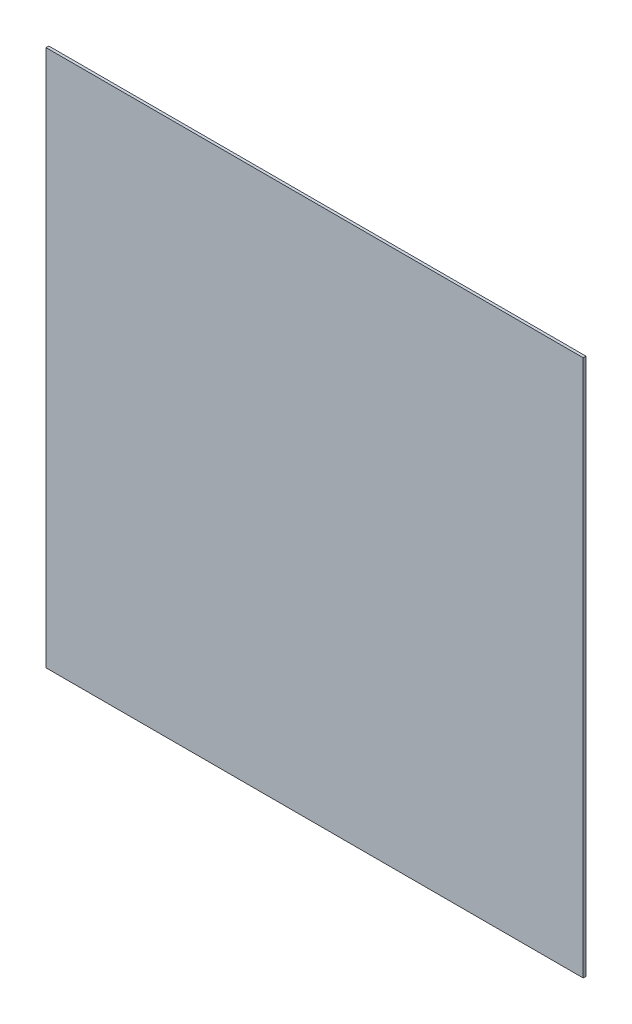
ISO-10303-21;
HEADER;
FILE_DESCRIPTION(('STEP AP214'),'2;1');
FILE_NAME('part.step','',(''),(''),'','','');
FILE_SCHEMA(('AUTOMOTIVE_DESIGN { 1 0 10303 214 1 1 1 1 }'));
ENDSEC;
DATA;
#1=APPLICATION_CONTEXT('core data for automotive mechanical design processes');
#2=APPLICATION_PROTOCOL_DEFINITION('international standard','automotive_design',2000,#1);
#3=PRODUCT_CONTEXT('',#1,'mechanical');
#4=PRODUCT('Part','Part','',(#3));
#5=PRODUCT_RELATED_PRODUCT_CATEGORY('part','',(#4));
#6=PRODUCT_DEFINITION_FORMATION('','',#4);
#7=PRODUCT_DEFINITION_CONTEXT('part definition',#1,'design');
#8=PRODUCT_DEFINITION('design','',#6,#7);
#9=PRODUCT_DEFINITION_SHAPE('','',#8);
#10=(LENGTH_UNIT() NAMED_UNIT(*) SI_UNIT(.MILLI.,.METRE.));
#11=(NAMED_UNIT(*) PLANE_ANGLE_UNIT() SI_UNIT($,.RADIAN.));
#12=(NAMED_UNIT(*) SI_UNIT($,.STERADIAN.) SOLID_ANGLE_UNIT());
#13=UNCERTAINTY_MEASURE_WITH_UNIT(LENGTH_MEASURE(1.E-05),#10,'distance_accuracy_value','');
#14=(GEOMETRIC_REPRESENTATION_CONTEXT(3) GLOBAL_UNCERTAINTY_ASSIGNED_CONTEXT((#13)) GLOBAL_UNIT_ASSIGNED_CONTEXT((#10,
#11,#12)) REPRESENTATION_CONTEXT('',''));
#15=CARTESIAN_POINT('',(0.,0.,0.));
#16=DIRECTION('',(0.,0.,1.));
#17=DIRECTION('',(1.,0.,0.));
#18=AXIS2_PLACEMENT_3D('',#15,#16,#17);
#19=CARTESIAN_POINT('',(194.,194.,0.));
#20=DIRECTION('',(0.,0.,1.));
#21=DIRECTION('',(1.,0.,0.));
#22=AXIS2_PLACEMENT_3D('',#19,#20,#21);
#23=PLANE('',#22);
#24=DIRECTION('',(0.,1.,0.));
#25=VECTOR('',#24,1.);
#26=CARTESIAN_POINT('',(0.,388.,0.));
#27=LINE('',#26,#25);
#28=CARTESIAN_POINT('',(0.,388.,0.));
#29=VERTEX_POINT('',#28);
#30=CARTESIAN_POINT('',(0.,0.,0.));
#31=VERTEX_POINT('',#30);
#32=EDGE_CURVE('E79',#29,#31,#27,.F.);
#33=ORIENTED_EDGE('',*,*,#32,.F.);
#34=DIRECTION('',(1.,0.,0.));
#35=VECTOR('',#34,1.);
#36=CARTESIAN_POINT('',(388.,388.,0.));
#37=LINE('',#36,#35);
#38=CARTESIAN_POINT('',(388.,388.,0.));
#39=VERTEX_POINT('',#38);
#40=EDGE_CURVE('E55',#39,#29,#37,.F.);
#41=ORIENTED_EDGE('',*,*,#40,.F.);
#42=DIRECTION('',(0.,1.,0.));
#43=VECTOR('',#42,1.);
#44=CARTESIAN_POINT('',(388.,0.,0.));
#45=LINE('',#44,#43);
#46=CARTESIAN_POINT('',(388.,0.,0.));
#47=VERTEX_POINT('',#46);
#48=EDGE_CURVE('E57',#47,#39,#45,.T.);
#49=ORIENTED_EDGE('',*,*,#48,.F.);
#50=DIRECTION('',(1.,0.,0.));
#51=VECTOR('',#50,1.);
#52=CARTESIAN_POINT('',(0.,0.,0.));
#53=LINE('',#52,#51);
#54=EDGE_CURVE('E20',#31,#47,#53,.T.);
#55=ORIENTED_EDGE('',*,*,#54,.F.);
#56=EDGE_LOOP('',(#33,#41,#49,#55));
#57=FACE_BOUND('',#56,.T.);
#58=ADVANCED_FACE('F17',(#57),#23,.F.);
#59=CARTESIAN_POINT('',(0.,0.,0.));
#60=DIRECTION('',(0.,-1.,0.));
#61=DIRECTION('',(0.,0.,-1.));
#62=AXIS2_PLACEMENT_3D('',#59,#60,#61);
#63=PLANE('',#62);
#64=DIRECTION('',(1.,0.,0.));
#65=VECTOR('',#64,1.);
#66=CARTESIAN_POINT('',(194.,0.,2.));
#67=LINE('',#66,#65);
#68=CARTESIAN_POINT('',(0.,0.,2.));
#69=VERTEX_POINT('',#68);
#70=CARTESIAN_POINT('',(388.,0.,2.));
#71=VERTEX_POINT('',#70);
#72=EDGE_CURVE('E83',#69,#71,#67,.T.);
#73=ORIENTED_EDGE('',*,*,#72,.F.);
#74=DIRECTION('',(0.,0.,1.));
#75=VECTOR('',#74,1.);
#76=CARTESIAN_POINT('',(0.,0.,0.));
#77=LINE('',#76,#75);
#78=EDGE_CURVE('E68',#31,#69,#77,.T.);
#79=ORIENTED_EDGE('',*,*,#78,.F.);
#80=ORIENTED_EDGE('',*,*,#54,.T.);
#81=DIRECTION('',(0.,0.,-1.));
#82=VECTOR('',#81,1.);
#83=CARTESIAN_POINT('',(388.,0.,0.));
#84=LINE('',#83,#82);
#85=EDGE_CURVE('E63',#71,#47,#84,.T.);
#86=ORIENTED_EDGE('',*,*,#85,.F.);
#87=EDGE_LOOP('',(#73,#79,#80,#86));
#88=FACE_BOUND('',#87,.T.);
#89=ADVANCED_FACE('F65',(#88),#63,.T.);
#90=CARTESIAN_POINT('',(388.,0.,0.));
#91=DIRECTION('',(1.,0.,0.));
#92=DIRECTION('',(0.,0.,-1.));
#93=AXIS2_PLACEMENT_3D('',#90,#91,#92);
#94=PLANE('',#93);
#95=DIRECTION('',(0.,1.,0.));
#96=VECTOR('',#95,1.);
#97=CARTESIAN_POINT('',(388.,194.,2.));
#98=LINE('',#97,#96);
#99=CARTESIAN_POINT('',(388.,388.,2.));
#100=VERTEX_POINT('',#99);
#101=EDGE_CURVE('E72',#71,#100,#98,.T.);
#102=ORIENTED_EDGE('',*,*,#101,.F.);
#103=ORIENTED_EDGE('',*,*,#85,.T.);
#104=ORIENTED_EDGE('',*,*,#48,.T.);
#105=DIRECTION('',(0.,0.,1.));
#106=VECTOR('',#105,1.);
#107=CARTESIAN_POINT('',(388.,388.,0.));
#108=LINE('',#107,#106);
#109=EDGE_CURVE('E75',#100,#39,#108,.F.);
#110=ORIENTED_EDGE('',*,*,#109,.F.);
#111=EDGE_LOOP('',(#102,#103,#104,#110));
#112=FACE_BOUND('',#111,.T.);
#113=ADVANCED_FACE('F70',(#112),#94,.T.);
#114=CARTESIAN_POINT('',(388.,388.,0.));
#115=DIRECTION('',(0.,1.,0.));
#116=DIRECTION('',(0.,0.,1.));
#117=AXIS2_PLACEMENT_3D('',#114,#115,#116);
#118=PLANE('',#117);
#119=DIRECTION('',(1.,0.,0.));
#120=VECTOR('',#119,1.);
#121=CARTESIAN_POINT('',(194.,388.,2.));
#122=LINE('',#121,#120);
#123=CARTESIAN_POINT('',(0.,388.,2.));
#124=VERTEX_POINT('',#123);
#125=EDGE_CURVE('E26',#100,#124,#122,.F.);
#126=ORIENTED_EDGE('',*,*,#125,.F.);
#127=ORIENTED_EDGE('',*,*,#109,.T.);
#128=ORIENTED_EDGE('',*,*,#40,.T.);
#129=DIRECTION('',(0.,0.,1.));
#130=VECTOR('',#129,1.);
#131=CARTESIAN_POINT('',(0.,388.,0.));
#132=LINE('',#131,#130);
#133=EDGE_CURVE('E35',#124,#29,#132,.F.);
#134=ORIENTED_EDGE('',*,*,#133,.F.);
#135=EDGE_LOOP('',(#126,#127,#128,#134));
#136=FACE_BOUND('',#135,.T.);
#137=ADVANCED_FACE('F89',(#136),#118,.T.);
#138=CARTESIAN_POINT('',(0.,388.,0.));
#139=DIRECTION('',(-1.,0.,0.));
#140=DIRECTION('',(0.,0.,1.));
#141=AXIS2_PLACEMENT_3D('',#138,#139,#140);
#142=PLANE('',#141);
#143=DIRECTION('',(0.,1.,0.));
#144=VECTOR('',#143,1.);
#145=CARTESIAN_POINT('',(0.,194.,2.));
#146=LINE('',#145,#144);
#147=EDGE_CURVE('E11',#124,#69,#146,.F.);
#148=ORIENTED_EDGE('',*,*,#147,.F.);
#149=ORIENTED_EDGE('',*,*,#133,.T.);
#150=ORIENTED_EDGE('',*,*,#32,.T.);
#151=ORIENTED_EDGE('',*,*,#78,.T.);
#152=EDGE_LOOP('',(#148,#149,#150,#151));
#153=FACE_BOUND('',#152,.T.);
#154=ADVANCED_FACE('F91',(#153),#142,.T.);
#155=CARTESIAN_POINT('',(194.,194.,2.));
#156=DIRECTION('',(0.,0.,1.));
#157=DIRECTION('',(1.,0.,0.));
#158=AXIS2_PLACEMENT_3D('',#155,#156,#157);
#159=PLANE('',#158);
#160=ORIENTED_EDGE('',*,*,#125,.T.);
#161=ORIENTED_EDGE('',*,*,#147,.T.);
#162=ORIENTED_EDGE('',*,*,#72,.T.);
#163=ORIENTED_EDGE('',*,*,#101,.T.);
#164=EDGE_LOOP('',(#160,#161,#162,#163));
#165=FACE_BOUND('',#164,.T.);
#166=ADVANCED_FACE('F88',(#165),#159,.T.);
#167=CLOSED_SHELL('',(#58,#89,#113,#137,#154,#166));
#168=MANIFOLD_SOLID_BREP('B1',#167);
#169=ADVANCED_BREP_SHAPE_REPRESENTATION('',(#18,#168),#14);
#170=SHAPE_DEFINITION_REPRESENTATION(#9,#169);
ENDSEC;
END-ISO-10303-21;
